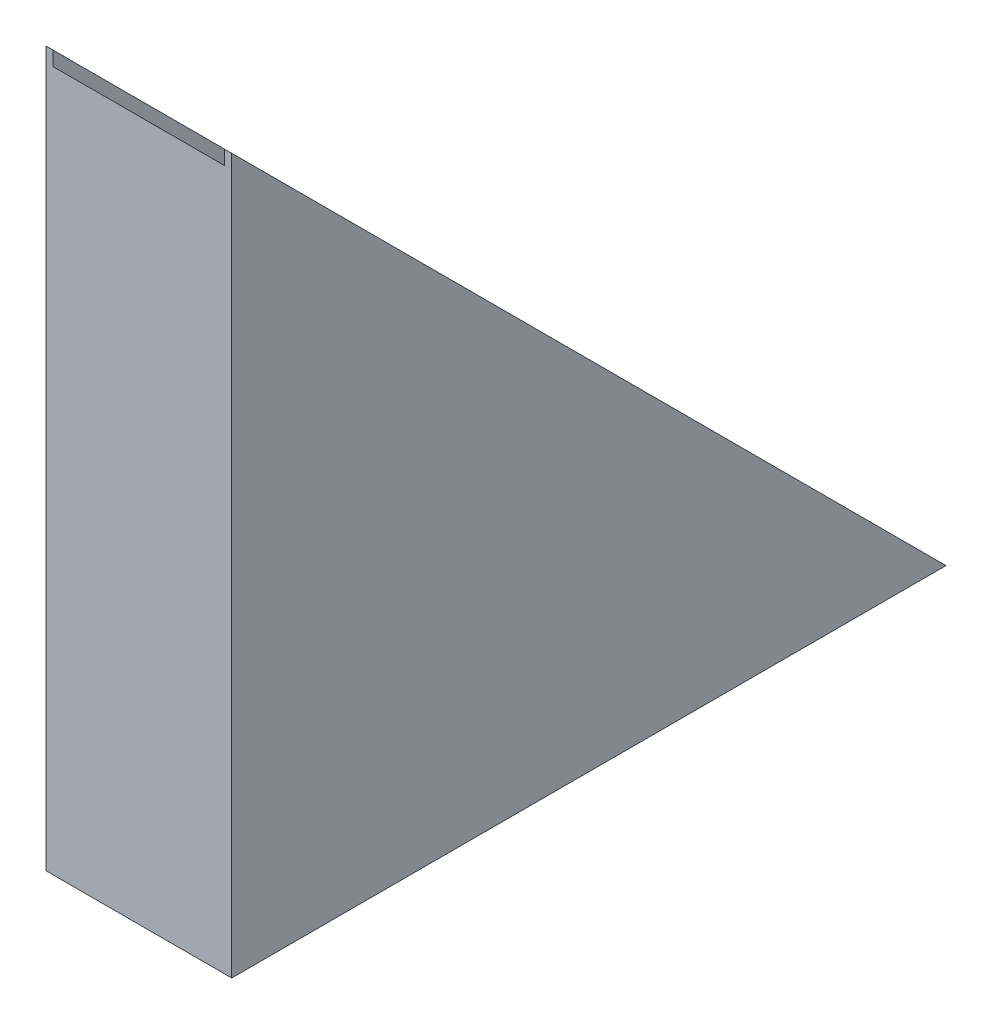
ISO-10303-21;
HEADER;
FILE_DESCRIPTION(('STEP AP214'),'2;1');
FILE_NAME('part.step','',(''),(''),'','','');
FILE_SCHEMA(('AUTOMOTIVE_DESIGN { 1 0 10303 214 1 1 1 1 }'));
ENDSEC;
DATA;
#1=APPLICATION_CONTEXT('core data for automotive mechanical design processes');
#2=APPLICATION_PROTOCOL_DEFINITION('international standard','automotive_design',2000,#1);
#3=PRODUCT_CONTEXT('',#1,'mechanical');
#4=PRODUCT('Part','Part','',(#3));
#5=PRODUCT_RELATED_PRODUCT_CATEGORY('part','',(#4));
#6=PRODUCT_DEFINITION_FORMATION('','',#4);
#7=PRODUCT_DEFINITION_CONTEXT('part definition',#1,'design');
#8=PRODUCT_DEFINITION('design','',#6,#7);
#9=PRODUCT_DEFINITION_SHAPE('','',#8);
#10=(LENGTH_UNIT() NAMED_UNIT(*) SI_UNIT(.MILLI.,.METRE.));
#11=(NAMED_UNIT(*) PLANE_ANGLE_UNIT() SI_UNIT($,.RADIAN.));
#12=(NAMED_UNIT(*) SI_UNIT($,.STERADIAN.) SOLID_ANGLE_UNIT());
#13=UNCERTAINTY_MEASURE_WITH_UNIT(LENGTH_MEASURE(1.E-05),#10,'distance_accuracy_value','');
#14=(GEOMETRIC_REPRESENTATION_CONTEXT(3) GLOBAL_UNCERTAINTY_ASSIGNED_CONTEXT((#13)) GLOBAL_UNIT_ASSIGNED_CONTEXT((#10,
#11,#12)) REPRESENTATION_CONTEXT('',''));
#15=CARTESIAN_POINT('',(0.,0.,0.));
#16=DIRECTION('',(0.,0.,1.));
#17=DIRECTION('',(1.,0.,0.));
#18=AXIS2_PLACEMENT_3D('',#15,#16,#17);
#19=CARTESIAN_POINT('',(650.,0.,-2500.));
#20=DIRECTION('',(0.,-0.707106781186551,0.707106781186543));
#21=DIRECTION('',(0.,-0.707106781186544,-0.707106781186552));
#22=AXIS2_PLACEMENT_3D('',#19,#20,#21);
#23=PLANE('',#22);
#24=DIRECTION('',(0.,0.707106781186544,0.707106781186551));
#25=VECTOR('',#24,1.);
#26=CARTESIAN_POINT('',(25.,-24.9999999999999,-2525.));
#27=LINE('',#26,#25);
#28=CARTESIAN_POINT('',(25.,0.,-2500.));
#29=VERTEX_POINT('',#28);
#30=CARTESIAN_POINT('',(25.,2499.99999999997,0.));
#31=VERTEX_POINT('',#30);
#32=EDGE_CURVE('E102',#29,#31,#27,.T.);
#33=ORIENTED_EDGE('',*,*,#32,.F.);
#34=DIRECTION('',(-1.,0.,0.));
#35=VECTOR('',#34,1.);
#36=CARTESIAN_POINT('',(650.,0.,-2500.));
#37=LINE('',#36,#35);
#38=CARTESIAN_POINT('',(0.,0.,-2500.));
#39=VERTEX_POINT('',#38);
#40=EDGE_CURVE('E123',#29,#39,#37,.T.);
#41=ORIENTED_EDGE('',*,*,#40,.T.);
#42=DIRECTION('',(0.,0.707106781186544,0.707106781186551));
#43=VECTOR('',#42,1.);
#44=CARTESIAN_POINT('',(0.,0.,-2500.));
#45=LINE('',#44,#43);
#46=CARTESIAN_POINT('',(0.,2499.99999999997,0.));
#47=VERTEX_POINT('',#46);
#48=EDGE_CURVE('E118',#39,#47,#45,.T.);
#49=ORIENTED_EDGE('',*,*,#48,.T.);
#50=DIRECTION('',(-1.,0.,0.));
#51=VECTOR('',#50,1.);
#52=CARTESIAN_POINT('',(650.,2499.99999999997,0.));
#53=LINE('',#52,#51);
#54=EDGE_CURVE('E75',#31,#47,#53,.T.);
#55=ORIENTED_EDGE('',*,*,#54,.F.);
#56=EDGE_LOOP('',(#33,#41,#49,#55));
#57=FACE_BOUND('',#56,.T.);
#58=ADVANCED_FACE('F33',(#57),#23,.F.);
#59=CARTESIAN_POINT('',(650.,2499.99999999997,0.));
#60=DIRECTION('',(0.,0.,-1.));
#61=DIRECTION('',(-1.,0.,0.));
#62=AXIS2_PLACEMENT_3D('',#59,#60,#61);
#63=PLANE('',#62);
#64=DIRECTION('',(0.,-1.,0.));
#65=VECTOR('',#64,1.);
#66=CARTESIAN_POINT('',(25.0000000000004,-24.9999999999999,0.));
#67=LINE('',#66,#65);
#68=CARTESIAN_POINT('',(25.,2449.99999999997,0.));
#69=VERTEX_POINT('',#68);
#70=EDGE_CURVE('E105',#31,#69,#67,.T.);
#71=ORIENTED_EDGE('',*,*,#70,.F.);
#72=ORIENTED_EDGE('',*,*,#54,.T.);
#73=DIRECTION('',(0.,-1.,0.));
#74=VECTOR('',#73,1.);
#75=CARTESIAN_POINT('',(0.,2499.99999999997,0.));
#76=LINE('',#75,#74);
#77=CARTESIAN_POINT('',(0.,0.,0.));
#78=VERTEX_POINT('',#77);
#79=EDGE_CURVE('E134',#47,#78,#76,.T.);
#80=ORIENTED_EDGE('',*,*,#79,.T.);
#81=DIRECTION('',(-1.,0.,0.));
#82=VECTOR('',#81,1.);
#83=CARTESIAN_POINT('',(650.,0.,0.));
#84=LINE('',#83,#82);
#85=CARTESIAN_POINT('',(650.,0.,0.));
#86=VERTEX_POINT('',#85);
#87=EDGE_CURVE('E11',#86,#78,#84,.T.);
#88=ORIENTED_EDGE('',*,*,#87,.F.);
#89=DIRECTION('',(0.,-1.,0.));
#90=VECTOR('',#89,1.);
#91=CARTESIAN_POINT('',(650.,2499.99999999997,0.));
#92=LINE('',#91,#90);
#93=CARTESIAN_POINT('',(650.,2499.99999999997,0.));
#94=VERTEX_POINT('',#93);
#95=EDGE_CURVE('E136',#94,#86,#92,.T.);
#96=ORIENTED_EDGE('',*,*,#95,.F.);
#97=CARTESIAN_POINT('',(625.,2499.99999999997,0.));
#98=VERTEX_POINT('',#97);
#99=EDGE_CURVE('E120',#94,#98,#53,.T.);
#100=ORIENTED_EDGE('',*,*,#99,.T.);
#101=DIRECTION('',(0.,1.,0.));
#102=VECTOR('',#101,1.);
#103=CARTESIAN_POINT('',(625.,-24.9999999999999,0.));
#104=LINE('',#103,#102);
#105=CARTESIAN_POINT('',(625.,2449.99999999997,0.));
#106=VERTEX_POINT('',#105);
#107=EDGE_CURVE('E48',#106,#98,#104,.T.);
#108=ORIENTED_EDGE('',*,*,#107,.F.);
#109=DIRECTION('',(1.,0.,0.));
#110=VECTOR('',#109,1.);
#111=CARTESIAN_POINT('',(25.,2449.99999999997,0.));
#112=LINE('',#111,#110);
#113=EDGE_CURVE('E114',#69,#106,#112,.T.);
#114=ORIENTED_EDGE('',*,*,#113,.F.);
#115=EDGE_LOOP('',(#71,#72,#80,#88,#96,#100,#108,#114));
#116=FACE_BOUND('',#115,.T.);
#117=ADVANCED_FACE('F35',(#116),#63,.F.);
#118=CARTESIAN_POINT('',(650.,0.,0.));
#119=DIRECTION('',(0.,1.,0.));
#120=DIRECTION('',(0.,0.,1.));
#121=AXIS2_PLACEMENT_3D('',#118,#119,#120);
#122=PLANE('',#121);
#123=DIRECTION('',(0.,0.,-1.));
#124=VECTOR('',#123,1.);
#125=CARTESIAN_POINT('',(25.,0.,-2525.));
#126=LINE('',#125,#124);
#127=CARTESIAN_POINT('',(25.,0.,-2450.));
#128=VERTEX_POINT('',#127);
#129=EDGE_CURVE('E108',#128,#29,#126,.T.);
#130=ORIENTED_EDGE('',*,*,#129,.F.);
#131=DIRECTION('',(-1.,0.,0.));
#132=VECTOR('',#131,1.);
#133=CARTESIAN_POINT('',(25.,0.,-2450.));
#134=LINE('',#133,#132);
#135=CARTESIAN_POINT('',(625.,0.,-2450.));
#136=VERTEX_POINT('',#135);
#137=EDGE_CURVE('E144',#136,#128,#134,.T.);
#138=ORIENTED_EDGE('',*,*,#137,.F.);
#139=DIRECTION('',(0.,0.,1.));
#140=VECTOR('',#139,1.);
#141=CARTESIAN_POINT('',(625.,0.,-2525.));
#142=LINE('',#141,#140);
#143=CARTESIAN_POINT('',(625.,0.,-2500.));
#144=VERTEX_POINT('',#143);
#145=EDGE_CURVE('E115',#144,#136,#142,.T.);
#146=ORIENTED_EDGE('',*,*,#145,.F.);
#147=CARTESIAN_POINT('',(650.,0.,-2500.));
#148=VERTEX_POINT('',#147);
#149=EDGE_CURVE('E41',#148,#144,#37,.T.);
#150=ORIENTED_EDGE('',*,*,#149,.F.);
#151=DIRECTION('',(0.,0.,-1.));
#152=VECTOR('',#151,1.);
#153=CARTESIAN_POINT('',(650.,0.,0.));
#154=LINE('',#153,#152);
#155=EDGE_CURVE('E80',#86,#148,#154,.T.);
#156=ORIENTED_EDGE('',*,*,#155,.F.);
#157=ORIENTED_EDGE('',*,*,#87,.T.);
#158=DIRECTION('',(0.,0.,-1.));
#159=VECTOR('',#158,1.);
#160=CARTESIAN_POINT('',(0.,0.,0.));
#161=LINE('',#160,#159);
#162=EDGE_CURVE('E130',#78,#39,#161,.T.);
#163=ORIENTED_EDGE('',*,*,#162,.T.);
#164=ORIENTED_EDGE('',*,*,#40,.F.);
#165=EDGE_LOOP('',(#130,#138,#146,#150,#156,#157,#163,#164));
#166=FACE_BOUND('',#165,.T.);
#167=ADVANCED_FACE('F131',(#166),#122,.F.);
#168=ORIENTED_EDGE('',*,*,#149,.T.);
#169=DIRECTION('',(0.,0.707106781186544,0.707106781186551));
#170=VECTOR('',#169,1.);
#171=CARTESIAN_POINT('',(625.,-24.9999999999999,-2525.));
#172=LINE('',#171,#170);
#173=EDGE_CURVE('E141',#144,#98,#172,.T.);
#174=ORIENTED_EDGE('',*,*,#173,.T.);
#175=ORIENTED_EDGE('',*,*,#99,.F.);
#176=DIRECTION('',(0.,0.707106781186544,0.707106781186551));
#177=VECTOR('',#176,1.);
#178=CARTESIAN_POINT('',(650.,0.,-2500.));
#179=LINE('',#178,#177);
#180=EDGE_CURVE('E57',#148,#94,#179,.T.);
#181=ORIENTED_EDGE('',*,*,#180,.F.);
#182=EDGE_LOOP('',(#168,#174,#175,#181));
#183=FACE_BOUND('',#182,.T.);
#184=ADVANCED_FACE('F153',(#183),#23,.F.);
#185=CARTESIAN_POINT('',(650.,0.,0.));
#186=DIRECTION('',(1.,0.,0.));
#187=DIRECTION('',(0.,0.,-1.));
#188=AXIS2_PLACEMENT_3D('',#185,#186,#187);
#189=PLANE('',#188);
#190=ORIENTED_EDGE('',*,*,#95,.T.);
#191=ORIENTED_EDGE('',*,*,#155,.T.);
#192=ORIENTED_EDGE('',*,*,#180,.T.);
#193=EDGE_LOOP('',(#190,#191,#192));
#194=FACE_BOUND('',#193,.T.);
#195=ADVANCED_FACE('F174',(#194),#189,.T.);
#196=CARTESIAN_POINT('',(0.,0.,0.));
#197=DIRECTION('',(1.,0.,0.));
#198=DIRECTION('',(0.,0.,-1.));
#199=AXIS2_PLACEMENT_3D('',#196,#197,#198);
#200=PLANE('',#199);
#201=ORIENTED_EDGE('',*,*,#79,.F.);
#202=ORIENTED_EDGE('',*,*,#48,.F.);
#203=ORIENTED_EDGE('',*,*,#162,.F.);
#204=EDGE_LOOP('',(#201,#202,#203));
#205=FACE_BOUND('',#204,.T.);
#206=ADVANCED_FACE('F135',(#205),#200,.F.);
#207=CARTESIAN_POINT('',(25.,-24.9999999999999,-2525.));
#208=DIRECTION('',(-1.,0.,0.));
#209=DIRECTION('',(0.,-1.,0.));
#210=AXIS2_PLACEMENT_3D('',#207,#208,#209);
#211=PLANE('',#210);
#212=ORIENTED_EDGE('',*,*,#129,.T.);
#213=ORIENTED_EDGE('',*,*,#32,.T.);
#214=ORIENTED_EDGE('',*,*,#70,.T.);
#215=DIRECTION('',(0.,0.707106781186544,0.707106781186551));
#216=VECTOR('',#215,1.);
#217=CARTESIAN_POINT('',(25.,-74.9999999999997,-2525.));
#218=LINE('',#217,#216);
#219=EDGE_CURVE('E111',#128,#69,#218,.T.);
#220=ORIENTED_EDGE('',*,*,#219,.F.);
#221=EDGE_LOOP('',(#212,#213,#214,#220));
#222=FACE_BOUND('',#221,.T.);
#223=ADVANCED_FACE('F103',(#222),#211,.F.);
#224=CARTESIAN_POINT('',(25.,-74.9999999999997,-2525.));
#225=DIRECTION('',(0.,-0.707106781186551,0.707106781186544));
#226=DIRECTION('',(0.,-0.707106781186544,-0.707106781186551));
#227=AXIS2_PLACEMENT_3D('',#224,#225,#226);
#228=PLANE('',#227);
#229=ORIENTED_EDGE('',*,*,#137,.T.);
#230=ORIENTED_EDGE('',*,*,#219,.T.);
#231=ORIENTED_EDGE('',*,*,#113,.T.);
#232=DIRECTION('',(0.,0.707106781186544,0.707106781186551));
#233=VECTOR('',#232,1.);
#234=CARTESIAN_POINT('',(625.,-74.9999999999997,-2525.));
#235=LINE('',#234,#233);
#236=EDGE_CURVE('E151',#136,#106,#235,.T.);
#237=ORIENTED_EDGE('',*,*,#236,.F.);
#238=EDGE_LOOP('',(#229,#230,#231,#237));
#239=FACE_BOUND('',#238,.T.);
#240=ADVANCED_FACE('F158',(#239),#228,.F.);
#241=CARTESIAN_POINT('',(625.,-24.9999999999999,-2525.));
#242=DIRECTION('',(1.,0.,0.));
#243=DIRECTION('',(0.,0.,-1.));
#244=AXIS2_PLACEMENT_3D('',#241,#242,#243);
#245=PLANE('',#244);
#246=ORIENTED_EDGE('',*,*,#145,.T.);
#247=ORIENTED_EDGE('',*,*,#236,.T.);
#248=ORIENTED_EDGE('',*,*,#107,.T.);
#249=ORIENTED_EDGE('',*,*,#173,.F.);
#250=EDGE_LOOP('',(#246,#247,#248,#249));
#251=FACE_BOUND('',#250,.T.);
#252=ADVANCED_FACE('F155',(#251),#245,.F.);
#253=CLOSED_SHELL('',(#58,#117,#167,#184,#195,#206,#223,#240,#252));
#254=MANIFOLD_SOLID_BREP('B2',#253);
#255=ADVANCED_BREP_SHAPE_REPRESENTATION('',(#18,#254),#14);
#256=SHAPE_DEFINITION_REPRESENTATION(#9,#255);
ENDSEC;
END-ISO-10303-21;
